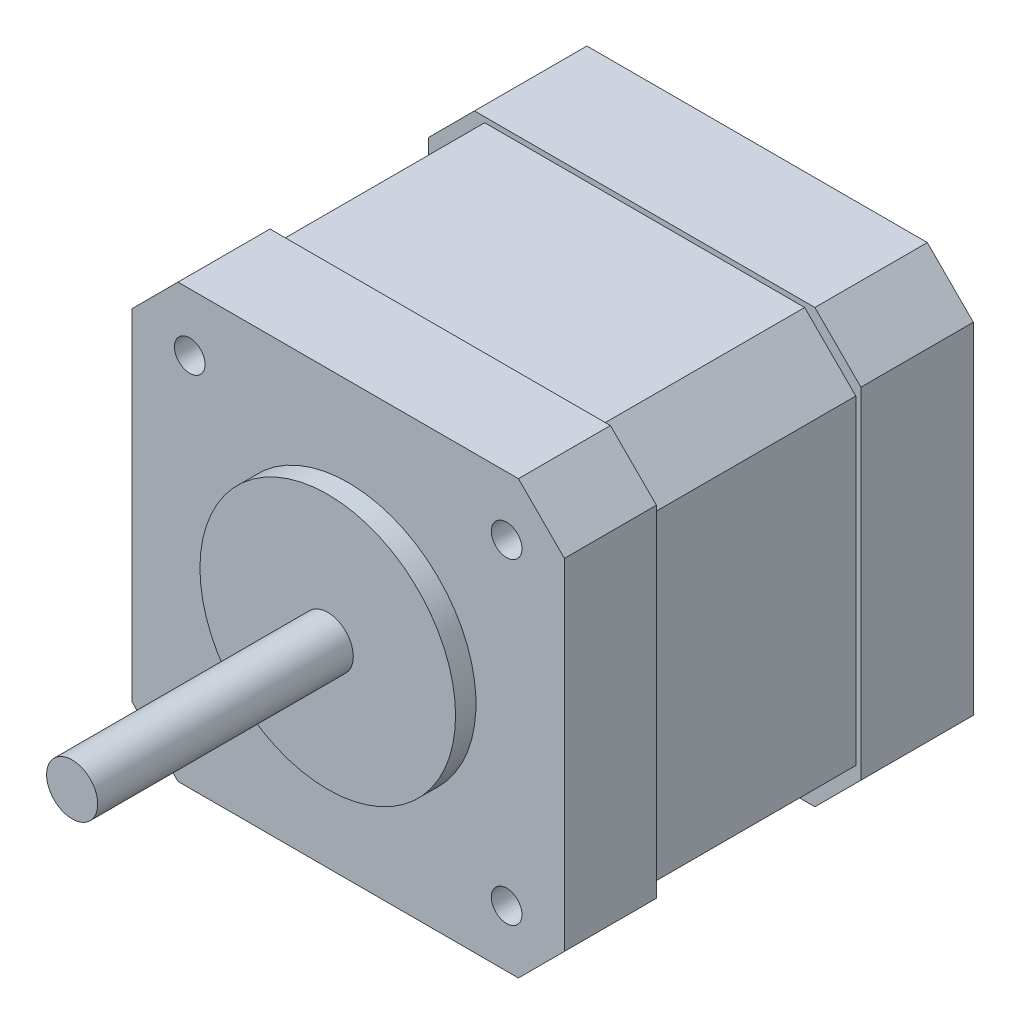
ISO-10303-21;
HEADER;
FILE_DESCRIPTION(('STEP AP214'),'2;1');
FILE_NAME('part.step','',(''),(''),'','','');
FILE_SCHEMA(('AUTOMOTIVE_DESIGN { 1 0 10303 214 1 1 1 1 }'));
ENDSEC;
DATA;
#1=APPLICATION_CONTEXT('core data for automotive mechanical design processes');
#2=APPLICATION_PROTOCOL_DEFINITION('international standard','automotive_design',2000,#1);
#3=PRODUCT_CONTEXT('',#1,'mechanical');
#4=PRODUCT('Part','Part','',(#3));
#5=PRODUCT_RELATED_PRODUCT_CATEGORY('part','',(#4));
#6=PRODUCT_DEFINITION_FORMATION('','',#4);
#7=PRODUCT_DEFINITION_CONTEXT('part definition',#1,'design');
#8=PRODUCT_DEFINITION('design','',#6,#7);
#9=PRODUCT_DEFINITION_SHAPE('','',#8);
#10=(LENGTH_UNIT() NAMED_UNIT(*) SI_UNIT(.MILLI.,.METRE.));
#11=(NAMED_UNIT(*) PLANE_ANGLE_UNIT() SI_UNIT($,.RADIAN.));
#12=(NAMED_UNIT(*) SI_UNIT($,.STERADIAN.) SOLID_ANGLE_UNIT());
#13=UNCERTAINTY_MEASURE_WITH_UNIT(LENGTH_MEASURE(1.E-05),#10,'distance_accuracy_value','');
#14=(GEOMETRIC_REPRESENTATION_CONTEXT(3) GLOBAL_UNCERTAINTY_ASSIGNED_CONTEXT((#13)) GLOBAL_UNIT_ASSIGNED_CONTEXT((#10,
#11,#12)) REPRESENTATION_CONTEXT('',''));
#15=CARTESIAN_POINT('',(0.,0.,0.));
#16=DIRECTION('',(0.,0.,1.));
#17=DIRECTION('',(1.,0.,0.));
#18=AXIS2_PLACEMENT_3D('',#15,#16,#17);
#19=CARTESIAN_POINT('',(21.15,21.15,42.));
#20=DIRECTION('',(0.,0.,1.));
#21=DIRECTION('',(1.,0.,0.));
#22=AXIS2_PLACEMENT_3D('',#19,#20,#21);
#23=PLANE('',#22);
#24=CARTESIAN_POINT('',(21.15,21.15,42.));
#25=DIRECTION('',(0.,0.,1.));
#26=DIRECTION('',(1.,0.,0.));
#27=AXIS2_PLACEMENT_3D('',#24,#25,#26);
#28=CIRCLE('',#27,12.5);
#29=CARTESIAN_POINT('',(33.65,21.15,42.));
#30=VERTEX_POINT('',#29);
#31=EDGE_CURVE('E513',#30,#30,#28,.T.);
#32=ORIENTED_EDGE('',*,*,#31,.T.);
#33=EDGE_LOOP('',(#32));
#34=FACE_BOUND('',#33,.T.);
#35=CARTESIAN_POINT('',(21.15,21.15,42.));
#36=DIRECTION('',(0.,0.,1.));
#37=DIRECTION('',(1.,0.,0.));
#38=AXIS2_PLACEMENT_3D('',#35,#36,#37);
#39=CIRCLE('',#38,2.5);
#40=CARTESIAN_POINT('',(23.65,21.15,42.));
#41=VERTEX_POINT('',#40);
#42=EDGE_CURVE('E558',#41,#41,#39,.T.);
#43=ORIENTED_EDGE('',*,*,#42,.F.);
#44=EDGE_LOOP('',(#43));
#45=FACE_BOUND('',#44,.T.);
#46=ADVANCED_FACE('F32',(#34,#45),#23,.T.);
#47=CARTESIAN_POINT('',(0.,42.3,40.));
#48=DIRECTION('',(0.,0.,-1.));
#49=DIRECTION('',(-1.,0.,0.));
#50=AXIS2_PLACEMENT_3D('',#47,#48,#49);
#51=PLANE('',#50);
#52=CARTESIAN_POINT('',(36.65,36.5364371724971,40.));
#53=DIRECTION('',(0.,0.,1.));
#54=DIRECTION('',(1.,0.,0.));
#55=AXIS2_PLACEMENT_3D('',#52,#53,#54);
#56=CIRCLE('',#55,1.5);
#57=CARTESIAN_POINT('',(38.15,36.5364371724971,40.));
#58=VERTEX_POINT('',#57);
#59=EDGE_CURVE('E583',#58,#58,#56,.T.);
#60=ORIENTED_EDGE('',*,*,#59,.F.);
#61=EDGE_LOOP('',(#60));
#62=FACE_BOUND('',#61,.T.);
#63=CARTESIAN_POINT('',(36.65,5.53643717249706,40.));
#64=DIRECTION('',(0.,0.,1.));
#65=DIRECTION('',(1.,0.,0.));
#66=AXIS2_PLACEMENT_3D('',#63,#64,#65);
#67=CIRCLE('',#66,1.5);
#68=CARTESIAN_POINT('',(38.15,5.53643717249706,40.));
#69=VERTEX_POINT('',#68);
#70=EDGE_CURVE('E577',#69,#69,#67,.T.);
#71=ORIENTED_EDGE('',*,*,#70,.F.);
#72=EDGE_LOOP('',(#71));
#73=FACE_BOUND('',#72,.T.);
#74=CARTESIAN_POINT('',(5.65,5.65,40.));
#75=DIRECTION('',(0.,0.,1.));
#76=DIRECTION('',(1.,0.,0.));
#77=AXIS2_PLACEMENT_3D('',#74,#75,#76);
#78=CIRCLE('',#77,1.5);
#79=CARTESIAN_POINT('',(7.15,5.65,40.));
#80=VERTEX_POINT('',#79);
#81=EDGE_CURVE('E571',#80,#80,#78,.T.);
#82=ORIENTED_EDGE('',*,*,#81,.F.);
#83=EDGE_LOOP('',(#82));
#84=FACE_BOUND('',#83,.T.);
#85=CARTESIAN_POINT('',(5.65,36.65,40.));
#86=DIRECTION('',(0.,0.,1.));
#87=DIRECTION('',(1.,0.,0.));
#88=AXIS2_PLACEMENT_3D('',#85,#86,#87);
#89=CIRCLE('',#88,1.5);
#90=CARTESIAN_POINT('',(7.15,36.65,40.));
#91=VERTEX_POINT('',#90);
#92=EDGE_CURVE('E565',#91,#91,#89,.T.);
#93=ORIENTED_EDGE('',*,*,#92,.F.);
#94=EDGE_LOOP('',(#93));
#95=FACE_BOUND('',#94,.T.);
#96=DIRECTION('',(0.,-1.,0.));
#97=VECTOR('',#96,1.);
#98=CARTESIAN_POINT('',(0.,0.,40.));
#99=LINE('',#98,#97);
#100=CARTESIAN_POINT('',(0.,37.8,40.));
#101=VERTEX_POINT('',#100);
#102=CARTESIAN_POINT('',(0.,4.50000000000002,40.));
#103=VERTEX_POINT('',#102);
#104=EDGE_CURVE('E499',#101,#103,#99,.T.);
#105=ORIENTED_EDGE('',*,*,#104,.T.);
#106=DIRECTION('',(-0.707106781186546,0.707106781186549,0.));
#107=VECTOR('',#106,1.);
#108=CARTESIAN_POINT('',(4.5,0.,40.));
#109=LINE('',#108,#107);
#110=CARTESIAN_POINT('',(4.5,0.,40.));
#111=VERTEX_POINT('',#110);
#112=EDGE_CURVE('E336',#103,#111,#109,.F.);
#113=ORIENTED_EDGE('',*,*,#112,.T.);
#114=DIRECTION('',(1.,0.,0.));
#115=VECTOR('',#114,1.);
#116=CARTESIAN_POINT('',(0.,0.,40.));
#117=LINE('',#116,#115);
#118=CARTESIAN_POINT('',(37.8,0.,40.));
#119=VERTEX_POINT('',#118);
#120=EDGE_CURVE('E504',#111,#119,#117,.T.);
#121=ORIENTED_EDGE('',*,*,#120,.T.);
#122=DIRECTION('',(-0.707106781186549,-0.707106781186546,0.));
#123=VECTOR('',#122,1.);
#124=CARTESIAN_POINT('',(42.3,4.5,40.));
#125=LINE('',#124,#123);
#126=CARTESIAN_POINT('',(42.3,4.5,40.));
#127=VERTEX_POINT('',#126);
#128=EDGE_CURVE('E334',#119,#127,#125,.F.);
#129=ORIENTED_EDGE('',*,*,#128,.T.);
#130=DIRECTION('',(0.,1.,0.));
#131=VECTOR('',#130,1.);
#132=CARTESIAN_POINT('',(42.3,0.,40.));
#133=LINE('',#132,#131);
#134=CARTESIAN_POINT('',(42.3,37.8,40.));
#135=VERTEX_POINT('',#134);
#136=EDGE_CURVE('E508',#127,#135,#133,.T.);
#137=ORIENTED_EDGE('',*,*,#136,.T.);
#138=DIRECTION('',(0.707106781186546,-0.707106781186549,0.));
#139=VECTOR('',#138,1.);
#140=CARTESIAN_POINT('',(37.8,42.3,40.));
#141=LINE('',#140,#139);
#142=CARTESIAN_POINT('',(37.8,42.3,40.));
#143=VERTEX_POINT('',#142);
#144=EDGE_CURVE('E54',#135,#143,#141,.F.);
#145=ORIENTED_EDGE('',*,*,#144,.T.);
#146=DIRECTION('',(-1.,0.,0.));
#147=VECTOR('',#146,1.);
#148=CARTESIAN_POINT('',(0.,42.3,40.));
#149=LINE('',#148,#147);
#150=CARTESIAN_POINT('',(4.50000000000003,42.3,40.));
#151=VERTEX_POINT('',#150);
#152=EDGE_CURVE('E227',#143,#151,#149,.T.);
#153=ORIENTED_EDGE('',*,*,#152,.T.);
#154=DIRECTION('',(0.707106781186549,0.707106781186546,0.));
#155=VECTOR('',#154,1.);
#156=CARTESIAN_POINT('',(0.,37.8,40.));
#157=LINE('',#156,#155);
#158=EDGE_CURVE('E332',#151,#101,#157,.F.);
#159=ORIENTED_EDGE('',*,*,#158,.T.);
#160=EDGE_LOOP('',(#105,#113,#121,#129,#137,#145,#153,#159));
#161=FACE_BOUND('',#160,.T.);
#162=CARTESIAN_POINT('',(21.15,21.15,40.));
#163=DIRECTION('',(0.,0.,-1.));
#164=DIRECTION('',(-1.,0.,0.));
#165=AXIS2_PLACEMENT_3D('',#162,#163,#164);
#166=CIRCLE('',#165,12.5);
#167=CARTESIAN_POINT('',(8.65,21.15,40.));
#168=VERTEX_POINT('',#167);
#169=EDGE_CURVE('E247',#168,#168,#166,.F.);
#170=ORIENTED_EDGE('',*,*,#169,.F.);
#171=EDGE_LOOP('',(#170));
#172=FACE_BOUND('',#171,.T.);
#173=ADVANCED_FACE('F400',(#62,#73,#84,#95,#161,#172),#51,.F.);
#174=CARTESIAN_POINT('',(0.,42.3,11.));
#175=DIRECTION('',(0.,0.,-1.));
#176=DIRECTION('',(-1.,0.,0.));
#177=AXIS2_PLACEMENT_3D('',#174,#175,#176);
#178=PLANE('',#177);
#179=DIRECTION('',(0.,-1.,0.));
#180=VECTOR('',#179,1.);
#181=CARTESIAN_POINT('',(0.,0.,11.));
#182=LINE('',#181,#180);
#183=CARTESIAN_POINT('',(0.,37.8,11.));
#184=VERTEX_POINT('',#183);
#185=CARTESIAN_POINT('',(0.,4.50000000000002,11.));
#186=VERTEX_POINT('',#185);
#187=EDGE_CURVE('E234',#184,#186,#182,.T.);
#188=ORIENTED_EDGE('',*,*,#187,.T.);
#189=DIRECTION('',(-0.707106781186546,0.707106781186549,0.));
#190=VECTOR('',#189,1.);
#191=CARTESIAN_POINT('',(4.5,0.,11.));
#192=LINE('',#191,#190);
#193=CARTESIAN_POINT('',(4.5,0.,11.));
#194=VERTEX_POINT('',#193);
#195=EDGE_CURVE('E311',#186,#194,#192,.F.);
#196=ORIENTED_EDGE('',*,*,#195,.T.);
#197=DIRECTION('',(1.,0.,0.));
#198=VECTOR('',#197,1.);
#199=CARTESIAN_POINT('',(0.,0.,11.));
#200=LINE('',#199,#198);
#201=CARTESIAN_POINT('',(37.8,0.,11.));
#202=VERTEX_POINT('',#201);
#203=EDGE_CURVE('E237',#194,#202,#200,.T.);
#204=ORIENTED_EDGE('',*,*,#203,.T.);
#205=DIRECTION('',(-0.707106781186549,-0.707106781186546,0.));
#206=VECTOR('',#205,1.);
#207=CARTESIAN_POINT('',(42.3,4.5,11.));
#208=LINE('',#207,#206);
#209=CARTESIAN_POINT('',(42.3,4.5,11.));
#210=VERTEX_POINT('',#209);
#211=EDGE_CURVE('E309',#202,#210,#208,.F.);
#212=ORIENTED_EDGE('',*,*,#211,.T.);
#213=DIRECTION('',(0.,1.,0.));
#214=VECTOR('',#213,1.);
#215=CARTESIAN_POINT('',(42.3,0.,11.));
#216=LINE('',#215,#214);
#217=CARTESIAN_POINT('',(42.3,37.8,11.));
#218=VERTEX_POINT('',#217);
#219=EDGE_CURVE('E241',#210,#218,#216,.T.);
#220=ORIENTED_EDGE('',*,*,#219,.T.);
#221=DIRECTION('',(0.707106781186546,-0.707106781186549,0.));
#222=VECTOR('',#221,1.);
#223=CARTESIAN_POINT('',(37.8,42.3,11.));
#224=LINE('',#223,#222);
#225=CARTESIAN_POINT('',(37.8,42.3,11.));
#226=VERTEX_POINT('',#225);
#227=EDGE_CURVE('E305',#218,#226,#224,.F.);
#228=ORIENTED_EDGE('',*,*,#227,.T.);
#229=DIRECTION('',(-1.,0.,0.));
#230=VECTOR('',#229,1.);
#231=CARTESIAN_POINT('',(0.,42.3,11.));
#232=LINE('',#231,#230);
#233=CARTESIAN_POINT('',(4.50000000000003,42.3,11.));
#234=VERTEX_POINT('',#233);
#235=EDGE_CURVE('E244',#226,#234,#232,.T.);
#236=ORIENTED_EDGE('',*,*,#235,.T.);
#237=DIRECTION('',(0.707106781186549,0.707106781186546,0.));
#238=VECTOR('',#237,1.);
#239=CARTESIAN_POINT('',(0.,37.8,11.));
#240=LINE('',#239,#238);
#241=EDGE_CURVE('E307',#234,#184,#240,.F.);
#242=ORIENTED_EDGE('',*,*,#241,.T.);
#243=EDGE_LOOP('',(#188,#196,#204,#212,#220,#228,#236,#242));
#244=FACE_BOUND('',#243,.T.);
#245=DIRECTION('',(0.,-1.,0.));
#246=VECTOR('',#245,1.);
#247=CARTESIAN_POINT('',(0.5,0.5,11.));
#248=LINE('',#247,#246);
#249=CARTESIAN_POINT('',(0.5,36.8,11.));
#250=VERTEX_POINT('',#249);
#251=CARTESIAN_POINT('',(0.5,5.50000000000002,11.));
#252=VERTEX_POINT('',#251);
#253=EDGE_CURVE('E222',#250,#252,#248,.T.);
#254=ORIENTED_EDGE('',*,*,#253,.F.);
#255=DIRECTION('',(-0.70710678118655,-0.707106781186546,0.));
#256=VECTOR('',#255,1.);
#257=CARTESIAN_POINT('',(2.99999999999999,39.3,11.));
#258=LINE('',#257,#256);
#259=CARTESIAN_POINT('',(5.50000000000002,41.8,11.));
#260=VERTEX_POINT('',#259);
#261=EDGE_CURVE('E279',#250,#260,#258,.F.);
#262=ORIENTED_EDGE('',*,*,#261,.T.);
#263=DIRECTION('',(-1.,0.,0.));
#264=VECTOR('',#263,1.);
#265=CARTESIAN_POINT('',(0.5,41.8,11.));
#266=LINE('',#265,#264);
#267=CARTESIAN_POINT('',(36.8,41.8,11.));
#268=VERTEX_POINT('',#267);
#269=EDGE_CURVE('E225',#268,#260,#266,.T.);
#270=ORIENTED_EDGE('',*,*,#269,.F.);
#271=DIRECTION('',(-0.707106781186546,0.70710678118655,0.));
#272=VECTOR('',#271,1.);
#273=CARTESIAN_POINT('',(18.1500000000001,60.45,11.));
#274=LINE('',#273,#272);
#275=CARTESIAN_POINT('',(41.8,36.8,11.));
#276=VERTEX_POINT('',#275);
#277=EDGE_CURVE('E283',#268,#276,#274,.F.);
#278=ORIENTED_EDGE('',*,*,#277,.T.);
#279=DIRECTION('',(0.,1.,0.));
#280=VECTOR('',#279,1.);
#281=CARTESIAN_POINT('',(41.8,0.5,11.));
#282=LINE('',#281,#280);
#283=CARTESIAN_POINT('',(41.8,5.5,11.));
#284=VERTEX_POINT('',#283);
#285=EDGE_CURVE('E221',#284,#276,#282,.T.);
#286=ORIENTED_EDGE('',*,*,#285,.F.);
#287=DIRECTION('',(0.707106781186549,0.707106781186547,0.));
#288=VECTOR('',#287,1.);
#289=CARTESIAN_POINT('',(39.2999999999999,2.99999999999995,11.));
#290=LINE('',#289,#288);
#291=CARTESIAN_POINT('',(36.8,0.5,11.));
#292=VERTEX_POINT('',#291);
#293=EDGE_CURVE('E220',#284,#292,#290,.F.);
#294=ORIENTED_EDGE('',*,*,#293,.T.);
#295=DIRECTION('',(1.,0.,0.));
#296=VECTOR('',#295,1.);
#297=CARTESIAN_POINT('',(0.5,0.5,11.));
#298=LINE('',#297,#296);
#299=CARTESIAN_POINT('',(5.5,0.5,11.));
#300=VERTEX_POINT('',#299);
#301=EDGE_CURVE('E211',#300,#292,#298,.T.);
#302=ORIENTED_EDGE('',*,*,#301,.F.);
#303=DIRECTION('',(0.707106781186547,-0.707106781186549,0.));
#304=VECTOR('',#303,1.);
#305=CARTESIAN_POINT('',(-18.15,24.1500000000001,11.));
#306=LINE('',#305,#304);
#307=EDGE_CURVE('E194',#300,#252,#306,.F.);
#308=ORIENTED_EDGE('',*,*,#307,.T.);
#309=EDGE_LOOP('',(#254,#262,#270,#278,#286,#294,#302,#308));
#310=FACE_BOUND('',#309,.T.);
#311=ADVANCED_FACE('F218',(#244,#310),#178,.F.);
#312=CARTESIAN_POINT('',(0.,0.,11.));
#313=DIRECTION('',(1.,0.,0.));
#314=DIRECTION('',(0.,0.,-1.));
#315=AXIS2_PLACEMENT_3D('',#312,#313,#314);
#316=PLANE('',#315);
#317=DIRECTION('',(0.,-1.,0.));
#318=VECTOR('',#317,1.);
#319=CARTESIAN_POINT('',(0.,0.,0.));
#320=LINE('',#319,#318);
#321=CARTESIAN_POINT('',(0.,37.8,0.));
#322=VERTEX_POINT('',#321);
#323=CARTESIAN_POINT('',(0.,4.50000000000002,0.));
#324=VERTEX_POINT('',#323);
#325=EDGE_CURVE('E248',#322,#324,#320,.T.);
#326=ORIENTED_EDGE('',*,*,#325,.T.);
#327=DIRECTION('',(0.,0.,1.));
#328=VECTOR('',#327,1.);
#329=CARTESIAN_POINT('',(0.,4.50000000000002,11.));
#330=LINE('',#329,#328);
#331=EDGE_CURVE('E303',#324,#186,#330,.T.);
#332=ORIENTED_EDGE('',*,*,#331,.T.);
#333=ORIENTED_EDGE('',*,*,#187,.F.);
#334=DIRECTION('',(0.,0.,-1.));
#335=VECTOR('',#334,1.);
#336=CARTESIAN_POINT('',(0.,37.8,11.));
#337=LINE('',#336,#335);
#338=EDGE_CURVE('E300',#184,#322,#337,.T.);
#339=ORIENTED_EDGE('',*,*,#338,.T.);
#340=EDGE_LOOP('',(#326,#332,#333,#339));
#341=FACE_BOUND('',#340,.T.);
#342=ADVANCED_FACE('F371',(#341),#316,.F.);
#343=CARTESIAN_POINT('',(0.,0.,11.));
#344=DIRECTION('',(0.,1.,0.));
#345=DIRECTION('',(0.,0.,1.));
#346=AXIS2_PLACEMENT_3D('',#343,#344,#345);
#347=PLANE('',#346);
#348=ORIENTED_EDGE('',*,*,#203,.F.);
#349=DIRECTION('',(0.,0.,-1.));
#350=VECTOR('',#349,1.);
#351=CARTESIAN_POINT('',(4.5,0.,11.));
#352=LINE('',#351,#350);
#353=CARTESIAN_POINT('',(4.50000000000001,0.,0.));
#354=VERTEX_POINT('',#353);
#355=EDGE_CURVE('E289',#194,#354,#352,.T.);
#356=ORIENTED_EDGE('',*,*,#355,.T.);
#357=DIRECTION('',(1.,0.,0.));
#358=VECTOR('',#357,1.);
#359=CARTESIAN_POINT('',(0.,0.,0.));
#360=LINE('',#359,#358);
#361=CARTESIAN_POINT('',(37.8,0.,0.));
#362=VERTEX_POINT('',#361);
#363=EDGE_CURVE('E251',#354,#362,#360,.T.);
#364=ORIENTED_EDGE('',*,*,#363,.T.);
#365=DIRECTION('',(0.,0.,1.));
#366=VECTOR('',#365,1.);
#367=CARTESIAN_POINT('',(37.8,0.,11.));
#368=LINE('',#367,#366);
#369=EDGE_CURVE('E287',#362,#202,#368,.T.);
#370=ORIENTED_EDGE('',*,*,#369,.T.);
#371=EDGE_LOOP('',(#348,#356,#364,#370));
#372=FACE_BOUND('',#371,.T.);
#373=ADVANCED_FACE('F380',(#372),#347,.F.);
#374=CARTESIAN_POINT('',(42.3,0.,11.));
#375=DIRECTION('',(-1.,0.,0.));
#376=DIRECTION('',(0.,0.,1.));
#377=AXIS2_PLACEMENT_3D('',#374,#375,#376);
#378=PLANE('',#377);
#379=ORIENTED_EDGE('',*,*,#219,.F.);
#380=DIRECTION('',(0.,0.,-1.));
#381=VECTOR('',#380,1.);
#382=CARTESIAN_POINT('',(42.3,4.5,11.));
#383=LINE('',#382,#381);
#384=CARTESIAN_POINT('',(42.3,4.5,0.));
#385=VERTEX_POINT('',#384);
#386=EDGE_CURVE('E340',#210,#385,#383,.T.);
#387=ORIENTED_EDGE('',*,*,#386,.T.);
#388=DIRECTION('',(0.,1.,0.));
#389=VECTOR('',#388,1.);
#390=CARTESIAN_POINT('',(42.3,0.,0.));
#391=LINE('',#390,#389);
#392=CARTESIAN_POINT('',(42.3,37.8,0.));
#393=VERTEX_POINT('',#392);
#394=EDGE_CURVE('E255',#385,#393,#391,.T.);
#395=ORIENTED_EDGE('',*,*,#394,.T.);
#396=DIRECTION('',(0.,0.,1.));
#397=VECTOR('',#396,1.);
#398=CARTESIAN_POINT('',(42.3,37.8,11.));
#399=LINE('',#398,#397);
#400=EDGE_CURVE('E338',#393,#218,#399,.T.);
#401=ORIENTED_EDGE('',*,*,#400,.T.);
#402=EDGE_LOOP('',(#379,#387,#395,#401));
#403=FACE_BOUND('',#402,.T.);
#404=ADVANCED_FACE('F388',(#403),#378,.F.);
#405=CARTESIAN_POINT('',(0.,42.3,11.));
#406=DIRECTION('',(0.,-1.,0.));
#407=DIRECTION('',(0.,0.,-1.));
#408=AXIS2_PLACEMENT_3D('',#405,#406,#407);
#409=PLANE('',#408);
#410=DIRECTION('',(-1.,0.,0.));
#411=VECTOR('',#410,1.);
#412=CARTESIAN_POINT('',(0.,42.3,0.));
#413=LINE('',#412,#411);
#414=CARTESIAN_POINT('',(37.8,42.3,0.));
#415=VERTEX_POINT('',#414);
#416=CARTESIAN_POINT('',(4.50000000000003,42.3,0.));
#417=VERTEX_POINT('',#416);
#418=EDGE_CURVE('E238',#415,#417,#413,.T.);
#419=ORIENTED_EDGE('',*,*,#418,.T.);
#420=DIRECTION('',(0.,0.,1.));
#421=VECTOR('',#420,1.);
#422=CARTESIAN_POINT('',(4.50000000000003,42.3,11.));
#423=LINE('',#422,#421);
#424=EDGE_CURVE('E11',#417,#234,#423,.T.);
#425=ORIENTED_EDGE('',*,*,#424,.T.);
#426=ORIENTED_EDGE('',*,*,#235,.F.);
#427=DIRECTION('',(0.,0.,-1.));
#428=VECTOR('',#427,1.);
#429=CARTESIAN_POINT('',(37.8,42.3,11.));
#430=LINE('',#429,#428);
#431=EDGE_CURVE('E40',#226,#415,#430,.T.);
#432=ORIENTED_EDGE('',*,*,#431,.T.);
#433=EDGE_LOOP('',(#419,#425,#426,#432));
#434=FACE_BOUND('',#433,.T.);
#435=ADVANCED_FACE('F356',(#434),#409,.F.);
#436=CARTESIAN_POINT('',(0.,42.3,0.));
#437=DIRECTION('',(0.,0.,-1.));
#438=DIRECTION('',(-1.,0.,0.));
#439=AXIS2_PLACEMENT_3D('',#436,#437,#438);
#440=PLANE('',#439);
#441=ORIENTED_EDGE('',*,*,#363,.F.);
#442=DIRECTION('',(0.707106781186546,-0.707106781186549,0.));
#443=VECTOR('',#442,1.);
#444=CARTESIAN_POINT('',(-18.9,23.4000000000001,0.));
#445=LINE('',#444,#443);
#446=EDGE_CURVE('E298',#354,#324,#445,.F.);
#447=ORIENTED_EDGE('',*,*,#446,.T.);
#448=ORIENTED_EDGE('',*,*,#325,.F.);
#449=DIRECTION('',(-0.707106781186549,-0.707106781186546,0.));
#450=VECTOR('',#449,1.);
#451=CARTESIAN_POINT('',(2.25000000000001,40.05,0.));
#452=LINE('',#451,#450);
#453=EDGE_CURVE('E294',#322,#417,#452,.F.);
#454=ORIENTED_EDGE('',*,*,#453,.T.);
#455=ORIENTED_EDGE('',*,*,#418,.F.);
#456=DIRECTION('',(-0.707106781186546,0.707106781186549,0.));
#457=VECTOR('',#456,1.);
#458=CARTESIAN_POINT('',(18.9000000000001,61.2,0.));
#459=LINE('',#458,#457);
#460=EDGE_CURVE('E292',#415,#393,#459,.F.);
#461=ORIENTED_EDGE('',*,*,#460,.T.);
#462=ORIENTED_EDGE('',*,*,#394,.F.);
#463=DIRECTION('',(0.707106781186549,0.707106781186546,0.));
#464=VECTOR('',#463,1.);
#465=CARTESIAN_POINT('',(40.0499999999999,2.24999999999994,0.));
#466=LINE('',#465,#464);
#467=EDGE_CURVE('E296',#385,#362,#466,.F.);
#468=ORIENTED_EDGE('',*,*,#467,.T.);
#469=EDGE_LOOP('',(#441,#447,#448,#454,#455,#461,#462,#468));
#470=FACE_BOUND('',#469,.T.);
#471=ADVANCED_FACE('F362',(#470),#440,.T.);
#472=CARTESIAN_POINT('',(0.5,0.5,31.));
#473=DIRECTION('',(1.,0.,0.));
#474=DIRECTION('',(0.,0.,-1.));
#475=AXIS2_PLACEMENT_3D('',#472,#473,#474);
#476=PLANE('',#475);
#477=ORIENTED_EDGE('',*,*,#253,.T.);
#478=DIRECTION('',(0.,0.,1.));
#479=VECTOR('',#478,1.);
#480=CARTESIAN_POINT('',(0.5,5.50000000000002,31.));
#481=LINE('',#480,#479);
#482=CARTESIAN_POINT('',(0.5,5.50000000000002,31.));
#483=VERTEX_POINT('',#482);
#484=EDGE_CURVE('E199',#252,#483,#481,.T.);
#485=ORIENTED_EDGE('',*,*,#484,.T.);
#486=DIRECTION('',(0.,-1.,0.));
#487=VECTOR('',#486,1.);
#488=CARTESIAN_POINT('',(0.5,0.5,31.));
#489=LINE('',#488,#487);
#490=CARTESIAN_POINT('',(0.5,36.8,31.));
#491=VERTEX_POINT('',#490);
#492=EDGE_CURVE('E233',#491,#483,#489,.T.);
#493=ORIENTED_EDGE('',*,*,#492,.F.);
#494=DIRECTION('',(0.,0.,-1.));
#495=VECTOR('',#494,1.);
#496=CARTESIAN_POINT('',(0.5,36.8,31.));
#497=LINE('',#496,#495);
#498=EDGE_CURVE('E215',#491,#250,#497,.T.);
#499=ORIENTED_EDGE('',*,*,#498,.T.);
#500=EDGE_LOOP('',(#477,#485,#493,#499));
#501=FACE_BOUND('',#500,.T.);
#502=ADVANCED_FACE('F447',(#501),#476,.F.);
#503=CARTESIAN_POINT('',(0.5,0.5,31.));
#504=DIRECTION('',(0.,1.,0.));
#505=DIRECTION('',(0.,0.,1.));
#506=AXIS2_PLACEMENT_3D('',#503,#504,#505);
#507=PLANE('',#506);
#508=DIRECTION('',(1.,0.,0.));
#509=VECTOR('',#508,1.);
#510=CARTESIAN_POINT('',(0.5,0.5,31.));
#511=LINE('',#510,#509);
#512=CARTESIAN_POINT('',(5.5,0.5,31.));
#513=VERTEX_POINT('',#512);
#514=CARTESIAN_POINT('',(36.8,0.5,31.));
#515=VERTEX_POINT('',#514);
#516=EDGE_CURVE('E214',#513,#515,#511,.T.);
#517=ORIENTED_EDGE('',*,*,#516,.F.);
#518=DIRECTION('',(0.,0.,-1.));
#519=VECTOR('',#518,1.);
#520=CARTESIAN_POINT('',(5.50000000000001,0.5,31.));
#521=LINE('',#520,#519);
#522=EDGE_CURVE('E198',#513,#300,#521,.T.);
#523=ORIENTED_EDGE('',*,*,#522,.T.);
#524=ORIENTED_EDGE('',*,*,#301,.T.);
#525=DIRECTION('',(0.,0.,1.));
#526=VECTOR('',#525,1.);
#527=CARTESIAN_POINT('',(36.8,0.5,31.));
#528=LINE('',#527,#526);
#529=EDGE_CURVE('E216',#292,#515,#528,.T.);
#530=ORIENTED_EDGE('',*,*,#529,.T.);
#531=EDGE_LOOP('',(#517,#523,#524,#530));
#532=FACE_BOUND('',#531,.T.);
#533=ADVANCED_FACE('F210',(#532),#507,.F.);
#534=CARTESIAN_POINT('',(41.8,0.5,31.));
#535=DIRECTION('',(-1.,0.,0.));
#536=DIRECTION('',(0.,0.,1.));
#537=AXIS2_PLACEMENT_3D('',#534,#535,#536);
#538=PLANE('',#537);
#539=DIRECTION('',(0.,1.,0.));
#540=VECTOR('',#539,1.);
#541=CARTESIAN_POINT('',(41.8,0.5,31.));
#542=LINE('',#541,#540);
#543=CARTESIAN_POINT('',(41.8,5.5,31.));
#544=VERTEX_POINT('',#543);
#545=CARTESIAN_POINT('',(41.8,36.8,31.));
#546=VERTEX_POINT('',#545);
#547=EDGE_CURVE('E528',#544,#546,#542,.T.);
#548=ORIENTED_EDGE('',*,*,#547,.F.);
#549=DIRECTION('',(0.,0.,-1.));
#550=VECTOR('',#549,1.);
#551=CARTESIAN_POINT('',(41.8,5.50000000000001,31.));
#552=LINE('',#551,#550);
#553=EDGE_CURVE('E268',#544,#284,#552,.T.);
#554=ORIENTED_EDGE('',*,*,#553,.T.);
#555=ORIENTED_EDGE('',*,*,#285,.T.);
#556=DIRECTION('',(0.,0.,1.));
#557=VECTOR('',#556,1.);
#558=CARTESIAN_POINT('',(41.8,36.8,31.));
#559=LINE('',#558,#557);
#560=EDGE_CURVE('E266',#276,#546,#559,.T.);
#561=ORIENTED_EDGE('',*,*,#560,.T.);
#562=EDGE_LOOP('',(#548,#554,#555,#561));
#563=FACE_BOUND('',#562,.T.);
#564=ADVANCED_FACE('F440',(#563),#538,.F.);
#565=CARTESIAN_POINT('',(0.5,41.8,31.));
#566=DIRECTION('',(0.,-1.,0.));
#567=DIRECTION('',(0.,0.,-1.));
#568=AXIS2_PLACEMENT_3D('',#565,#566,#567);
#569=PLANE('',#568);
#570=ORIENTED_EDGE('',*,*,#269,.T.);
#571=DIRECTION('',(0.,0.,1.));
#572=VECTOR('',#571,1.);
#573=CARTESIAN_POINT('',(5.50000000000002,41.8,31.));
#574=LINE('',#573,#572);
#575=CARTESIAN_POINT('',(5.50000000000002,41.8,31.));
#576=VERTEX_POINT('',#575);
#577=EDGE_CURVE('E205',#260,#576,#574,.T.);
#578=ORIENTED_EDGE('',*,*,#577,.T.);
#579=DIRECTION('',(-1.,0.,0.));
#580=VECTOR('',#579,1.);
#581=CARTESIAN_POINT('',(0.5,41.8,31.));
#582=LINE('',#581,#580);
#583=CARTESIAN_POINT('',(36.8,41.8,31.));
#584=VERTEX_POINT('',#583);
#585=EDGE_CURVE('E252',#584,#576,#582,.T.);
#586=ORIENTED_EDGE('',*,*,#585,.F.);
#587=DIRECTION('',(0.,0.,-1.));
#588=VECTOR('',#587,1.);
#589=CARTESIAN_POINT('',(36.8,41.8,31.));
#590=LINE('',#589,#588);
#591=EDGE_CURVE('E271',#584,#268,#590,.T.);
#592=ORIENTED_EDGE('',*,*,#591,.T.);
#593=EDGE_LOOP('',(#570,#578,#586,#592));
#594=FACE_BOUND('',#593,.T.);
#595=ADVANCED_FACE('F423',(#594),#569,.F.);
#596=CARTESIAN_POINT('',(0.,42.3,31.));
#597=DIRECTION('',(0.,0.,-1.));
#598=DIRECTION('',(-1.,0.,0.));
#599=AXIS2_PLACEMENT_3D('',#596,#597,#598);
#600=PLANE('',#599);
#601=DIRECTION('',(1.,0.,0.));
#602=VECTOR('',#601,1.);
#603=CARTESIAN_POINT('',(0.,0.,31.));
#604=LINE('',#603,#602);
#605=CARTESIAN_POINT('',(4.50000000000001,0.,31.));
#606=VERTEX_POINT('',#605);
#607=CARTESIAN_POINT('',(37.8,0.,31.));
#608=VERTEX_POINT('',#607);
#609=EDGE_CURVE('E520',#606,#608,#604,.T.);
#610=ORIENTED_EDGE('',*,*,#609,.F.);
#611=DIRECTION('',(0.707106781186546,-0.707106781186549,0.));
#612=VECTOR('',#611,1.);
#613=CARTESIAN_POINT('',(-18.9,23.4000000000001,31.));
#614=LINE('',#613,#612);
#615=CARTESIAN_POINT('',(0.,4.50000000000002,31.));
#616=VERTEX_POINT('',#615);
#617=EDGE_CURVE('E324',#606,#616,#614,.F.);
#618=ORIENTED_EDGE('',*,*,#617,.T.);
#619=DIRECTION('',(0.,-1.,0.));
#620=VECTOR('',#619,1.);
#621=CARTESIAN_POINT('',(0.,0.,31.));
#622=LINE('',#621,#620);
#623=CARTESIAN_POINT('',(0.,37.8,31.));
#624=VERTEX_POINT('',#623);
#625=EDGE_CURVE('E518',#624,#616,#622,.T.);
#626=ORIENTED_EDGE('',*,*,#625,.F.);
#627=DIRECTION('',(-0.707106781186549,-0.707106781186546,0.));
#628=VECTOR('',#627,1.);
#629=CARTESIAN_POINT('',(2.25000000000001,40.05,31.));
#630=LINE('',#629,#628);
#631=CARTESIAN_POINT('',(4.50000000000003,42.3,31.));
#632=VERTEX_POINT('',#631);
#633=EDGE_CURVE('E320',#624,#632,#630,.F.);
#634=ORIENTED_EDGE('',*,*,#633,.T.);
#635=DIRECTION('',(-1.,0.,0.));
#636=VECTOR('',#635,1.);
#637=CARTESIAN_POINT('',(0.,42.3,31.));
#638=LINE('',#637,#636);
#639=CARTESIAN_POINT('',(37.8,42.3,31.));
#640=VERTEX_POINT('',#639);
#641=EDGE_CURVE('E505',#640,#632,#638,.T.);
#642=ORIENTED_EDGE('',*,*,#641,.F.);
#643=DIRECTION('',(-0.707106781186546,0.707106781186549,0.));
#644=VECTOR('',#643,1.);
#645=CARTESIAN_POINT('',(18.9000000000001,61.2,31.));
#646=LINE('',#645,#644);
#647=CARTESIAN_POINT('',(42.3,37.8,31.));
#648=VERTEX_POINT('',#647);
#649=EDGE_CURVE('E318',#640,#648,#646,.F.);
#650=ORIENTED_EDGE('',*,*,#649,.T.);
#651=DIRECTION('',(0.,1.,0.));
#652=VECTOR('',#651,1.);
#653=CARTESIAN_POINT('',(42.3,0.,31.));
#654=LINE('',#653,#652);
#655=CARTESIAN_POINT('',(42.3,4.5,31.));
#656=VERTEX_POINT('',#655);
#657=EDGE_CURVE('E510',#656,#648,#654,.T.);
#658=ORIENTED_EDGE('',*,*,#657,.F.);
#659=DIRECTION('',(0.707106781186549,0.707106781186546,0.));
#660=VECTOR('',#659,1.);
#661=CARTESIAN_POINT('',(40.0499999999999,2.24999999999994,31.));
#662=LINE('',#661,#660);
#663=EDGE_CURVE('E322',#656,#608,#662,.F.);
#664=ORIENTED_EDGE('',*,*,#663,.T.);
#665=EDGE_LOOP('',(#610,#618,#626,#634,#642,#650,#658,#664));
#666=FACE_BOUND('',#665,.T.);
#667=ORIENTED_EDGE('',*,*,#585,.T.);
#668=DIRECTION('',(0.70710678118655,0.707106781186546,0.));
#669=VECTOR('',#668,1.);
#670=CARTESIAN_POINT('',(0.5,36.8,31.));
#671=LINE('',#670,#669);
#672=EDGE_CURVE('E281',#576,#491,#671,.F.);
#673=ORIENTED_EDGE('',*,*,#672,.T.);
#674=ORIENTED_EDGE('',*,*,#492,.T.);
#675=DIRECTION('',(-0.707106781186547,0.707106781186549,0.));
#676=VECTOR('',#675,1.);
#677=CARTESIAN_POINT('',(5.50000000000001,0.5,31.));
#678=LINE('',#677,#676);
#679=EDGE_CURVE('E204',#483,#513,#678,.F.);
#680=ORIENTED_EDGE('',*,*,#679,.T.);
#681=ORIENTED_EDGE('',*,*,#516,.T.);
#682=DIRECTION('',(-0.707106781186549,-0.707106781186547,0.));
#683=VECTOR('',#682,1.);
#684=CARTESIAN_POINT('',(41.8,5.50000000000001,31.));
#685=LINE('',#684,#683);
#686=EDGE_CURVE('E277',#515,#544,#685,.F.);
#687=ORIENTED_EDGE('',*,*,#686,.T.);
#688=ORIENTED_EDGE('',*,*,#547,.T.);
#689=DIRECTION('',(0.707106781186546,-0.70710678118655,0.));
#690=VECTOR('',#689,1.);
#691=CARTESIAN_POINT('',(36.8,41.8,31.));
#692=LINE('',#691,#690);
#693=EDGE_CURVE('E285',#546,#584,#692,.F.);
#694=ORIENTED_EDGE('',*,*,#693,.T.);
#695=EDGE_LOOP('',(#667,#673,#674,#680,#681,#687,#688,#694));
#696=FACE_BOUND('',#695,.T.);
#697=ADVANCED_FACE('F419',(#666,#696),#600,.T.);
#698=CARTESIAN_POINT('',(0.,0.,40.));
#699=DIRECTION('',(1.,0.,0.));
#700=DIRECTION('',(0.,0.,-1.));
#701=AXIS2_PLACEMENT_3D('',#698,#699,#700);
#702=PLANE('',#701);
#703=ORIENTED_EDGE('',*,*,#625,.T.);
#704=DIRECTION('',(0.,0.,1.));
#705=VECTOR('',#704,1.);
#706=CARTESIAN_POINT('',(0.,4.50000000000002,40.));
#707=LINE('',#706,#705);
#708=EDGE_CURVE('E329',#616,#103,#707,.T.);
#709=ORIENTED_EDGE('',*,*,#708,.T.);
#710=ORIENTED_EDGE('',*,*,#104,.F.);
#711=DIRECTION('',(0.,0.,-1.));
#712=VECTOR('',#711,1.);
#713=CARTESIAN_POINT('',(0.,37.8,40.));
#714=LINE('',#713,#712);
#715=EDGE_CURVE('E326',#101,#624,#714,.T.);
#716=ORIENTED_EDGE('',*,*,#715,.T.);
#717=EDGE_LOOP('',(#703,#709,#710,#716));
#718=FACE_BOUND('',#717,.T.);
#719=ADVANCED_FACE('F422',(#718),#702,.F.);
#720=CARTESIAN_POINT('',(0.,0.,40.));
#721=DIRECTION('',(0.,1.,0.));
#722=DIRECTION('',(0.,0.,1.));
#723=AXIS2_PLACEMENT_3D('',#720,#721,#722);
#724=PLANE('',#723);
#725=ORIENTED_EDGE('',*,*,#120,.F.);
#726=DIRECTION('',(0.,0.,-1.));
#727=VECTOR('',#726,1.);
#728=CARTESIAN_POINT('',(4.5,0.,40.));
#729=LINE('',#728,#727);
#730=EDGE_CURVE('E315',#111,#606,#729,.T.);
#731=ORIENTED_EDGE('',*,*,#730,.T.);
#732=ORIENTED_EDGE('',*,*,#609,.T.);
#733=DIRECTION('',(0.,0.,1.));
#734=VECTOR('',#733,1.);
#735=CARTESIAN_POINT('',(37.8,0.,40.));
#736=LINE('',#735,#734);
#737=EDGE_CURVE('E313',#608,#119,#736,.T.);
#738=ORIENTED_EDGE('',*,*,#737,.T.);
#739=EDGE_LOOP('',(#725,#731,#732,#738));
#740=FACE_BOUND('',#739,.T.);
#741=ADVANCED_FACE('F430',(#740),#724,.F.);
#742=CARTESIAN_POINT('',(42.3,0.,40.));
#743=DIRECTION('',(-1.,0.,0.));
#744=DIRECTION('',(0.,0.,1.));
#745=AXIS2_PLACEMENT_3D('',#742,#743,#744);
#746=PLANE('',#745);
#747=ORIENTED_EDGE('',*,*,#136,.F.);
#748=DIRECTION('',(0.,0.,-1.));
#749=VECTOR('',#748,1.);
#750=CARTESIAN_POINT('',(42.3,4.5,40.));
#751=LINE('',#750,#749);
#752=EDGE_CURVE('E345',#127,#656,#751,.T.);
#753=ORIENTED_EDGE('',*,*,#752,.T.);
#754=ORIENTED_EDGE('',*,*,#657,.T.);
#755=DIRECTION('',(0.,0.,1.));
#756=VECTOR('',#755,1.);
#757=CARTESIAN_POINT('',(42.3,37.8,40.));
#758=LINE('',#757,#756);
#759=EDGE_CURVE('E343',#648,#135,#758,.T.);
#760=ORIENTED_EDGE('',*,*,#759,.T.);
#761=EDGE_LOOP('',(#747,#753,#754,#760));
#762=FACE_BOUND('',#761,.T.);
#763=ADVANCED_FACE('F427',(#762),#746,.F.);
#764=CARTESIAN_POINT('',(0.,42.3,40.));
#765=DIRECTION('',(0.,-1.,0.));
#766=DIRECTION('',(0.,0.,-1.));
#767=AXIS2_PLACEMENT_3D('',#764,#765,#766);
#768=PLANE('',#767);
#769=ORIENTED_EDGE('',*,*,#641,.T.);
#770=DIRECTION('',(0.,0.,1.));
#771=VECTOR('',#770,1.);
#772=CARTESIAN_POINT('',(4.50000000000003,42.3,40.));
#773=LINE('',#772,#771);
#774=EDGE_CURVE('E47',#632,#151,#773,.T.);
#775=ORIENTED_EDGE('',*,*,#774,.T.);
#776=ORIENTED_EDGE('',*,*,#152,.F.);
#777=DIRECTION('',(0.,0.,-1.));
#778=VECTOR('',#777,1.);
#779=CARTESIAN_POINT('',(37.8,42.3,40.));
#780=LINE('',#779,#778);
#781=EDGE_CURVE('E348',#143,#640,#780,.T.);
#782=ORIENTED_EDGE('',*,*,#781,.T.);
#783=EDGE_LOOP('',(#769,#775,#776,#782));
#784=FACE_BOUND('',#783,.T.);
#785=ADVANCED_FACE('F416',(#784),#768,.F.);
#786=CARTESIAN_POINT('',(21.15,21.15,42.));
#787=DIRECTION('',(0.,0.,-1.));
#788=DIRECTION('',(-1.,0.,0.));
#789=AXIS2_PLACEMENT_3D('',#786,#787,#788);
#790=CYLINDRICAL_SURFACE('',#789,12.5);
#791=ORIENTED_EDGE('',*,*,#31,.F.);
#792=EDGE_LOOP('',(#791));
#793=FACE_BOUND('',#792,.T.);
#794=ORIENTED_EDGE('',*,*,#169,.T.);
#795=EDGE_LOOP('',(#794));
#796=FACE_BOUND('',#795,.T.);
#797=ADVANCED_FACE('F414',(#793,#796),#790,.T.);
#798=CARTESIAN_POINT('',(21.15,21.15,67.));
#799=DIRECTION('',(0.,0.,-1.));
#800=DIRECTION('',(-1.,0.,0.));
#801=AXIS2_PLACEMENT_3D('',#798,#799,#800);
#802=CYLINDRICAL_SURFACE('',#801,2.5);
#803=CARTESIAN_POINT('',(21.15,21.15,67.));
#804=DIRECTION('',(0.,0.,1.));
#805=DIRECTION('',(1.,0.,0.));
#806=AXIS2_PLACEMENT_3D('',#803,#804,#805);
#807=CIRCLE('',#806,2.5);
#808=CARTESIAN_POINT('',(23.65,21.15,67.));
#809=VERTEX_POINT('',#808);
#810=EDGE_CURVE('E555',#809,#809,#807,.T.);
#811=ORIENTED_EDGE('',*,*,#810,.F.);
#812=EDGE_LOOP('',(#811));
#813=FACE_BOUND('',#812,.T.);
#814=ORIENTED_EDGE('',*,*,#42,.T.);
#815=EDGE_LOOP('',(#814));
#816=FACE_BOUND('',#815,.T.);
#817=ADVANCED_FACE('F412',(#813,#816),#802,.T.);
#818=CARTESIAN_POINT('',(21.15,21.15,67.));
#819=DIRECTION('',(0.,0.,1.));
#820=DIRECTION('',(1.,0.,0.));
#821=AXIS2_PLACEMENT_3D('',#818,#819,#820);
#822=PLANE('',#821);
#823=ORIENTED_EDGE('',*,*,#810,.T.);
#824=EDGE_LOOP('',(#823));
#825=FACE_BOUND('',#824,.T.);
#826=ADVANCED_FACE('F606',(#825),#822,.T.);
#827=CARTESIAN_POINT('',(5.65,36.65,25.));
#828=DIRECTION('',(0.,0.,1.));
#829=DIRECTION('',(1.,0.,0.));
#830=AXIS2_PLACEMENT_3D('',#827,#828,#829);
#831=CYLINDRICAL_SURFACE('',#830,1.5);
#832=CARTESIAN_POINT('',(5.65,36.65,25.));
#833=DIRECTION('',(0.,0.,1.));
#834=DIRECTION('',(1.,0.,0.));
#835=AXIS2_PLACEMENT_3D('',#832,#833,#834);
#836=CIRCLE('',#835,1.5);
#837=CARTESIAN_POINT('',(7.15,36.65,25.));
#838=VERTEX_POINT('',#837);
#839=EDGE_CURVE('E563',#838,#838,#836,.T.);
#840=ORIENTED_EDGE('',*,*,#839,.F.);
#841=EDGE_LOOP('',(#840));
#842=FACE_BOUND('',#841,.T.);
#843=ORIENTED_EDGE('',*,*,#92,.T.);
#844=EDGE_LOOP('',(#843));
#845=FACE_BOUND('',#844,.T.);
#846=ADVANCED_FACE('F603',(#842,#845),#831,.F.);
#847=CARTESIAN_POINT('',(5.65,36.65,25.));
#848=DIRECTION('',(0.,0.,1.));
#849=DIRECTION('',(1.,0.,0.));
#850=AXIS2_PLACEMENT_3D('',#847,#848,#849);
#851=PLANE('',#850);
#852=ORIENTED_EDGE('',*,*,#839,.T.);
#853=EDGE_LOOP('',(#852));
#854=FACE_BOUND('',#853,.T.);
#855=ADVANCED_FACE('F605',(#854),#851,.T.);
#856=CARTESIAN_POINT('',(5.65,5.65,25.));
#857=DIRECTION('',(0.,0.,1.));
#858=DIRECTION('',(1.,0.,0.));
#859=AXIS2_PLACEMENT_3D('',#856,#857,#858);
#860=CYLINDRICAL_SURFACE('',#859,1.5);
#861=CARTESIAN_POINT('',(5.65,5.65,25.));
#862=DIRECTION('',(0.,0.,1.));
#863=DIRECTION('',(1.,0.,0.));
#864=AXIS2_PLACEMENT_3D('',#861,#862,#863);
#865=CIRCLE('',#864,1.5);
#866=CARTESIAN_POINT('',(7.15,5.65,25.));
#867=VERTEX_POINT('',#866);
#868=EDGE_CURVE('E568',#867,#867,#865,.T.);
#869=ORIENTED_EDGE('',*,*,#868,.F.);
#870=EDGE_LOOP('',(#869));
#871=FACE_BOUND('',#870,.T.);
#872=ORIENTED_EDGE('',*,*,#81,.T.);
#873=EDGE_LOOP('',(#872));
#874=FACE_BOUND('',#873,.T.);
#875=ADVANCED_FACE('F613',(#871,#874),#860,.F.);
#876=CARTESIAN_POINT('',(5.65,5.65,25.));
#877=DIRECTION('',(0.,0.,1.));
#878=DIRECTION('',(1.,0.,0.));
#879=AXIS2_PLACEMENT_3D('',#876,#877,#878);
#880=PLANE('',#879);
#881=ORIENTED_EDGE('',*,*,#868,.T.);
#882=EDGE_LOOP('',(#881));
#883=FACE_BOUND('',#882,.T.);
#884=ADVANCED_FACE('F620',(#883),#880,.T.);
#885=CARTESIAN_POINT('',(36.65,5.53643717249706,25.));
#886=DIRECTION('',(0.,0.,1.));
#887=DIRECTION('',(1.,0.,0.));
#888=AXIS2_PLACEMENT_3D('',#885,#886,#887);
#889=CYLINDRICAL_SURFACE('',#888,1.5);
#890=CARTESIAN_POINT('',(36.65,5.53643717249706,25.));
#891=DIRECTION('',(0.,0.,1.));
#892=DIRECTION('',(1.,0.,0.));
#893=AXIS2_PLACEMENT_3D('',#890,#891,#892);
#894=CIRCLE('',#893,1.5);
#895=CARTESIAN_POINT('',(38.15,5.53643717249706,25.));
#896=VERTEX_POINT('',#895);
#897=EDGE_CURVE('E574',#896,#896,#894,.T.);
#898=ORIENTED_EDGE('',*,*,#897,.F.);
#899=EDGE_LOOP('',(#898));
#900=FACE_BOUND('',#899,.T.);
#901=ORIENTED_EDGE('',*,*,#70,.T.);
#902=EDGE_LOOP('',(#901));
#903=FACE_BOUND('',#902,.T.);
#904=ADVANCED_FACE('F624',(#900,#903),#889,.F.);
#905=CARTESIAN_POINT('',(36.65,5.53643717249706,25.));
#906=DIRECTION('',(0.,0.,1.));
#907=DIRECTION('',(1.,0.,0.));
#908=AXIS2_PLACEMENT_3D('',#905,#906,#907);
#909=PLANE('',#908);
#910=ORIENTED_EDGE('',*,*,#897,.T.);
#911=EDGE_LOOP('',(#910));
#912=FACE_BOUND('',#911,.T.);
#913=ADVANCED_FACE('F593',(#912),#909,.T.);
#914=CARTESIAN_POINT('',(36.65,36.5364371724971,25.));
#915=DIRECTION('',(0.,0.,1.));
#916=DIRECTION('',(1.,0.,0.));
#917=AXIS2_PLACEMENT_3D('',#914,#915,#916);
#918=CYLINDRICAL_SURFACE('',#917,1.5);
#919=CARTESIAN_POINT('',(36.65,36.5364371724971,25.));
#920=DIRECTION('',(0.,0.,1.));
#921=DIRECTION('',(1.,0.,0.));
#922=AXIS2_PLACEMENT_3D('',#919,#920,#921);
#923=CIRCLE('',#922,1.5);
#924=CARTESIAN_POINT('',(38.15,36.5364371724971,25.));
#925=VERTEX_POINT('',#924);
#926=EDGE_CURVE('E580',#925,#925,#923,.T.);
#927=ORIENTED_EDGE('',*,*,#926,.F.);
#928=EDGE_LOOP('',(#927));
#929=FACE_BOUND('',#928,.T.);
#930=ORIENTED_EDGE('',*,*,#59,.T.);
#931=EDGE_LOOP('',(#930));
#932=FACE_BOUND('',#931,.T.);
#933=ADVANCED_FACE('F590',(#929,#932),#918,.F.);
#934=CARTESIAN_POINT('',(36.65,36.5364371724971,25.));
#935=DIRECTION('',(0.,0.,1.));
#936=DIRECTION('',(1.,0.,0.));
#937=AXIS2_PLACEMENT_3D('',#934,#935,#936);
#938=PLANE('',#937);
#939=ORIENTED_EDGE('',*,*,#926,.T.);
#940=EDGE_LOOP('',(#939));
#941=FACE_BOUND('',#940,.T.);
#942=ADVANCED_FACE('F466',(#941),#938,.T.);
#943=CARTESIAN_POINT('',(5.50000000000001,0.5,31.));
#944=DIRECTION('',(0.707106781186549,0.707106781186547,0.));
#945=DIRECTION('',(-0.707106781186547,0.707106781186549,0.));
#946=AXIS2_PLACEMENT_3D('',#943,#944,#945);
#947=PLANE('',#946);
#948=ORIENTED_EDGE('',*,*,#679,.F.);
#949=ORIENTED_EDGE('',*,*,#484,.F.);
#950=ORIENTED_EDGE('',*,*,#307,.F.);
#951=ORIENTED_EDGE('',*,*,#522,.F.);
#952=EDGE_LOOP('',(#948,#949,#950,#951));
#953=FACE_BOUND('',#952,.T.);
#954=ADVANCED_FACE('F197',(#953),#947,.F.);
#955=CARTESIAN_POINT('',(41.8,5.50000000000001,31.));
#956=DIRECTION('',(-0.707106781186547,0.707106781186549,0.));
#957=DIRECTION('',(-0.707106781186549,-0.707106781186547,0.));
#958=AXIS2_PLACEMENT_3D('',#955,#956,#957);
#959=PLANE('',#958);
#960=ORIENTED_EDGE('',*,*,#686,.F.);
#961=ORIENTED_EDGE('',*,*,#529,.F.);
#962=ORIENTED_EDGE('',*,*,#293,.F.);
#963=ORIENTED_EDGE('',*,*,#553,.F.);
#964=EDGE_LOOP('',(#960,#961,#962,#963));
#965=FACE_BOUND('',#964,.T.);
#966=ADVANCED_FACE('F465',(#965),#959,.F.);
#967=CARTESIAN_POINT('',(0.5,36.8,31.));
#968=DIRECTION('',(0.707106781186545,-0.707106781186549,0.));
#969=DIRECTION('',(0.70710678118655,0.707106781186546,0.));
#970=AXIS2_PLACEMENT_3D('',#967,#968,#969);
#971=PLANE('',#970);
#972=ORIENTED_EDGE('',*,*,#672,.F.);
#973=ORIENTED_EDGE('',*,*,#577,.F.);
#974=ORIENTED_EDGE('',*,*,#261,.F.);
#975=ORIENTED_EDGE('',*,*,#498,.F.);
#976=EDGE_LOOP('',(#972,#973,#974,#975));
#977=FACE_BOUND('',#976,.T.);
#978=ADVANCED_FACE('F469',(#977),#971,.F.);
#979=CARTESIAN_POINT('',(36.8,41.8,31.));
#980=DIRECTION('',(-0.707106781186549,-0.707106781186545,0.));
#981=DIRECTION('',(0.707106781186546,-0.70710678118655,0.));
#982=AXIS2_PLACEMENT_3D('',#979,#980,#981);
#983=PLANE('',#982);
#984=ORIENTED_EDGE('',*,*,#693,.F.);
#985=ORIENTED_EDGE('',*,*,#560,.F.);
#986=ORIENTED_EDGE('',*,*,#277,.F.);
#987=ORIENTED_EDGE('',*,*,#591,.F.);
#988=EDGE_LOOP('',(#984,#985,#986,#987));
#989=FACE_BOUND('',#988,.T.);
#990=ADVANCED_FACE('F473',(#989),#983,.F.);
#991=CARTESIAN_POINT('',(4.5,0.,11.));
#992=DIRECTION('',(0.707106781186549,0.707106781186546,0.));
#993=DIRECTION('',(-0.707106781186546,0.707106781186549,0.));
#994=AXIS2_PLACEMENT_3D('',#991,#992,#993);
#995=PLANE('',#994);
#996=ORIENTED_EDGE('',*,*,#195,.F.);
#997=ORIENTED_EDGE('',*,*,#331,.F.);
#998=ORIENTED_EDGE('',*,*,#446,.F.);
#999=ORIENTED_EDGE('',*,*,#355,.F.);
#1000=EDGE_LOOP('',(#996,#997,#998,#999));
#1001=FACE_BOUND('',#1000,.T.);
#1002=ADVANCED_FACE('F378',(#1001),#995,.F.);
#1003=CARTESIAN_POINT('',(4.5,0.,40.));
#1004=DIRECTION('',(0.707106781186549,0.707106781186546,0.));
#1005=DIRECTION('',(-0.707106781186546,0.707106781186549,0.));
#1006=AXIS2_PLACEMENT_3D('',#1003,#1004,#1005);
#1007=PLANE('',#1006);
#1008=ORIENTED_EDGE('',*,*,#112,.F.);
#1009=ORIENTED_EDGE('',*,*,#708,.F.);
#1010=ORIENTED_EDGE('',*,*,#617,.F.);
#1011=ORIENTED_EDGE('',*,*,#730,.F.);
#1012=EDGE_LOOP('',(#1008,#1009,#1010,#1011));
#1013=FACE_BOUND('',#1012,.T.);
#1014=ADVANCED_FACE('F480',(#1013),#1007,.F.);
#1015=CARTESIAN_POINT('',(42.3,4.5,11.));
#1016=DIRECTION('',(-0.707106781186546,0.707106781186549,0.));
#1017=DIRECTION('',(-0.707106781186549,-0.707106781186546,0.));
#1018=AXIS2_PLACEMENT_3D('',#1015,#1016,#1017);
#1019=PLANE('',#1018);
#1020=ORIENTED_EDGE('',*,*,#211,.F.);
#1021=ORIENTED_EDGE('',*,*,#369,.F.);
#1022=ORIENTED_EDGE('',*,*,#467,.F.);
#1023=ORIENTED_EDGE('',*,*,#386,.F.);
#1024=EDGE_LOOP('',(#1020,#1021,#1022,#1023));
#1025=FACE_BOUND('',#1024,.T.);
#1026=ADVANCED_FACE('F385',(#1025),#1019,.F.);
#1027=CARTESIAN_POINT('',(42.3,4.5,40.));
#1028=DIRECTION('',(-0.707106781186546,0.707106781186549,0.));
#1029=DIRECTION('',(-0.707106781186549,-0.707106781186546,0.));
#1030=AXIS2_PLACEMENT_3D('',#1027,#1028,#1029);
#1031=PLANE('',#1030);
#1032=ORIENTED_EDGE('',*,*,#128,.F.);
#1033=ORIENTED_EDGE('',*,*,#737,.F.);
#1034=ORIENTED_EDGE('',*,*,#663,.F.);
#1035=ORIENTED_EDGE('',*,*,#752,.F.);
#1036=EDGE_LOOP('',(#1032,#1033,#1034,#1035));
#1037=FACE_BOUND('',#1036,.T.);
#1038=ADVANCED_FACE('F486',(#1037),#1031,.F.);
#1039=CARTESIAN_POINT('',(0.,37.8,40.));
#1040=DIRECTION('',(0.707106781186547,-0.707106781186549,0.));
#1041=DIRECTION('',(0.707106781186549,0.707106781186546,0.));
#1042=AXIS2_PLACEMENT_3D('',#1039,#1040,#1041);
#1043=PLANE('',#1042);
#1044=ORIENTED_EDGE('',*,*,#158,.F.);
#1045=ORIENTED_EDGE('',*,*,#774,.F.);
#1046=ORIENTED_EDGE('',*,*,#633,.F.);
#1047=ORIENTED_EDGE('',*,*,#715,.F.);
#1048=EDGE_LOOP('',(#1044,#1045,#1046,#1047));
#1049=FACE_BOUND('',#1048,.T.);
#1050=ADVANCED_FACE('F397',(#1049),#1043,.F.);
#1051=CARTESIAN_POINT('',(0.,37.8,11.));
#1052=DIRECTION('',(0.707106781186547,-0.707106781186549,0.));
#1053=DIRECTION('',(0.707106781186549,0.707106781186546,0.));
#1054=AXIS2_PLACEMENT_3D('',#1051,#1052,#1053);
#1055=PLANE('',#1054);
#1056=ORIENTED_EDGE('',*,*,#241,.F.);
#1057=ORIENTED_EDGE('',*,*,#424,.F.);
#1058=ORIENTED_EDGE('',*,*,#453,.F.);
#1059=ORIENTED_EDGE('',*,*,#338,.F.);
#1060=EDGE_LOOP('',(#1056,#1057,#1058,#1059));
#1061=FACE_BOUND('',#1060,.T.);
#1062=ADVANCED_FACE('F368',(#1061),#1055,.F.);
#1063=CARTESIAN_POINT('',(37.8,42.3,11.));
#1064=DIRECTION('',(-0.707106781186549,-0.707106781186546,0.));
#1065=DIRECTION('',(0.707106781186546,-0.707106781186549,0.));
#1066=AXIS2_PLACEMENT_3D('',#1063,#1064,#1065);
#1067=PLANE('',#1066);
#1068=ORIENTED_EDGE('',*,*,#227,.F.);
#1069=ORIENTED_EDGE('',*,*,#400,.F.);
#1070=ORIENTED_EDGE('',*,*,#460,.F.);
#1071=ORIENTED_EDGE('',*,*,#431,.F.);
#1072=EDGE_LOOP('',(#1068,#1069,#1070,#1071));
#1073=FACE_BOUND('',#1072,.T.);
#1074=ADVANCED_FACE('F390',(#1073),#1067,.F.);
#1075=CARTESIAN_POINT('',(37.8,42.3,40.));
#1076=DIRECTION('',(-0.707106781186549,-0.707106781186546,0.));
#1077=DIRECTION('',(0.707106781186546,-0.707106781186549,0.));
#1078=AXIS2_PLACEMENT_3D('',#1075,#1076,#1077);
#1079=PLANE('',#1078);
#1080=ORIENTED_EDGE('',*,*,#144,.F.);
#1081=ORIENTED_EDGE('',*,*,#759,.F.);
#1082=ORIENTED_EDGE('',*,*,#649,.F.);
#1083=ORIENTED_EDGE('',*,*,#781,.F.);
#1084=EDGE_LOOP('',(#1080,#1081,#1082,#1083));
#1085=FACE_BOUND('',#1084,.T.);
#1086=ADVANCED_FACE('F34',(#1085),#1079,.F.);
#1087=CLOSED_SHELL('',(#46,#173,#311,#342,#373,#404,#435,#471,#502,#533,#564,#595,#697,#719,
#741,#763,#785,#797,#817,#826,#846,#855,#875,#884,#904,#913,#933,#942,#954,#966,#978,#990,#1002,
#1014,#1026,#1038,#1050,#1062,#1074,#1086));
#1088=MANIFOLD_SOLID_BREP('B2',#1087);
#1089=ADVANCED_BREP_SHAPE_REPRESENTATION('',(#18,#1088),#14);
#1090=SHAPE_DEFINITION_REPRESENTATION(#9,#1089);
ENDSEC;
END-ISO-10303-21;
